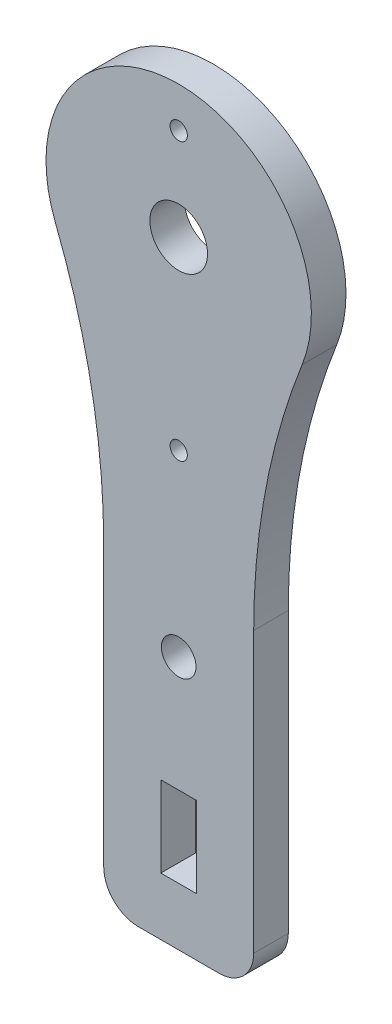
ISO-10303-21;
HEADER;
FILE_DESCRIPTION(('STEP AP214'),'2;1');
FILE_NAME('part.step','',(''),(''),'','','');
FILE_SCHEMA(('AUTOMOTIVE_DESIGN { 1 0 10303 214 1 1 1 1 }'));
ENDSEC;
DATA;
#1=APPLICATION_CONTEXT('core data for automotive mechanical design processes');
#2=APPLICATION_PROTOCOL_DEFINITION('international standard','automotive_design',2000,#1);
#3=PRODUCT_CONTEXT('',#1,'mechanical');
#4=PRODUCT('Part','Part','',(#3));
#5=PRODUCT_RELATED_PRODUCT_CATEGORY('part','',(#4));
#6=PRODUCT_DEFINITION_FORMATION('','',#4);
#7=PRODUCT_DEFINITION_CONTEXT('part definition',#1,'design');
#8=PRODUCT_DEFINITION('design','',#6,#7);
#9=PRODUCT_DEFINITION_SHAPE('','',#8);
#10=(LENGTH_UNIT() NAMED_UNIT(*) SI_UNIT(.MILLI.,.METRE.));
#11=(NAMED_UNIT(*) PLANE_ANGLE_UNIT() SI_UNIT($,.RADIAN.));
#12=(NAMED_UNIT(*) SI_UNIT($,.STERADIAN.) SOLID_ANGLE_UNIT());
#13=UNCERTAINTY_MEASURE_WITH_UNIT(LENGTH_MEASURE(1.E-05),#10,'distance_accuracy_value','');
#14=(GEOMETRIC_REPRESENTATION_CONTEXT(3) GLOBAL_UNCERTAINTY_ASSIGNED_CONTEXT((#13)) GLOBAL_UNIT_ASSIGNED_CONTEXT((#10,
#11,#12)) REPRESENTATION_CONTEXT('',''));
#15=CARTESIAN_POINT('',(0.,0.,0.));
#16=DIRECTION('',(0.,0.,1.));
#17=DIRECTION('',(1.,0.,0.));
#18=AXIS2_PLACEMENT_3D('',#15,#16,#17);
#19=CARTESIAN_POINT('',(6.50000000000002,0.,3.));
#20=DIRECTION('',(-1.,0.,0.));
#21=DIRECTION('',(0.,-1.,0.));
#22=AXIS2_PLACEMENT_3D('',#19,#20,#21);
#23=PLANE('',#22);
#24=DIRECTION('',(0.,1.,0.));
#25=VECTOR('',#24,1.);
#26=CARTESIAN_POINT('',(6.50000000000002,0.,3.));
#27=LINE('',#26,#25);
#28=CARTESIAN_POINT('',(6.50000000000001,-50.5,3.));
#29=VERTEX_POINT('',#28);
#30=CARTESIAN_POINT('',(6.50000000000001,-26.2678510731274,3.));
#31=VERTEX_POINT('',#30);
#32=EDGE_CURVE('E192',#29,#31,#27,.T.);
#33=ORIENTED_EDGE('',*,*,#32,.F.);
#34=DIRECTION('',(0.,0.,-1.));
#35=VECTOR('',#34,1.);
#36=CARTESIAN_POINT('',(6.50000000000001,-50.5,0.));
#37=LINE('',#36,#35);
#38=CARTESIAN_POINT('',(6.50000000000001,-50.5,0.));
#39=VERTEX_POINT('',#38);
#40=EDGE_CURVE('E11',#29,#39,#37,.T.);
#41=ORIENTED_EDGE('',*,*,#40,.T.);
#42=DIRECTION('',(0.,1.,0.));
#43=VECTOR('',#42,1.);
#44=CARTESIAN_POINT('',(6.50000000000002,0.,0.));
#45=LINE('',#44,#43);
#46=CARTESIAN_POINT('',(6.50000000000001,-26.2678510731274,0.));
#47=VERTEX_POINT('',#46);
#48=EDGE_CURVE('E208',#39,#47,#45,.T.);
#49=ORIENTED_EDGE('',*,*,#48,.T.);
#50=DIRECTION('',(0.,0.,1.));
#51=VECTOR('',#50,1.);
#52=CARTESIAN_POINT('',(6.50000000000001,-26.2678510731274,3.));
#53=LINE('',#52,#51);
#54=EDGE_CURVE('E228',#47,#31,#53,.T.);
#55=ORIENTED_EDGE('',*,*,#54,.T.);
#56=EDGE_LOOP('',(#33,#41,#49,#55));
#57=FACE_BOUND('',#56,.T.);
#58=ADVANCED_FACE('F41',(#57),#23,.F.);
#59=CARTESIAN_POINT('',(0.,0.,3.));
#60=DIRECTION('',(0.,0.,-1.));
#61=DIRECTION('',(-1.,0.,0.));
#62=AXIS2_PLACEMENT_3D('',#59,#60,#61);
#63=CYLINDRICAL_SURFACE('',#62,11.5);
#64=CARTESIAN_POINT('',(0.,0.,3.));
#65=DIRECTION('',(0.,0.,1.));
#66=DIRECTION('',(1.,0.,0.));
#67=AXIS2_PLACEMENT_3D('',#64,#65,#66);
#68=CIRCLE('',#67,11.5);
#69=CARTESIAN_POINT('',(10.6958041958042,-4.22489912364986,3.));
#70=VERTEX_POINT('',#69);
#71=CARTESIAN_POINT('',(-10.6958041958042,-4.22489912364986,3.));
#72=VERTEX_POINT('',#71);
#73=EDGE_CURVE('E195',#70,#72,#68,.T.);
#74=ORIENTED_EDGE('',*,*,#73,.F.);
#75=DIRECTION('',(0.,0.,-1.));
#76=VECTOR('',#75,1.);
#77=CARTESIAN_POINT('',(10.6958041958042,-4.22489912364986,3.));
#78=LINE('',#77,#76);
#79=CARTESIAN_POINT('',(10.6958041958042,-4.22489912364986,0.));
#80=VERTEX_POINT('',#79);
#81=EDGE_CURVE('E224',#70,#80,#78,.T.);
#82=ORIENTED_EDGE('',*,*,#81,.T.);
#83=CARTESIAN_POINT('',(0.,0.,0.));
#84=DIRECTION('',(0.,0.,1.));
#85=DIRECTION('',(1.,0.,0.));
#86=AXIS2_PLACEMENT_3D('',#83,#84,#85);
#87=CIRCLE('',#86,11.5);
#88=CARTESIAN_POINT('',(-10.6958041958042,-4.22489912364986,0.));
#89=VERTEX_POINT('',#88);
#90=EDGE_CURVE('E211',#80,#89,#87,.T.);
#91=ORIENTED_EDGE('',*,*,#90,.T.);
#92=DIRECTION('',(0.,0.,-1.));
#93=VECTOR('',#92,1.);
#94=CARTESIAN_POINT('',(-10.6958041958042,-4.22489912364986,3.));
#95=LINE('',#94,#93);
#96=EDGE_CURVE('E207',#89,#72,#95,.F.);
#97=ORIENTED_EDGE('',*,*,#96,.T.);
#98=EDGE_LOOP('',(#74,#82,#91,#97));
#99=FACE_BOUND('',#98,.T.);
#100=ADVANCED_FACE('F286',(#99),#63,.T.);
#101=CARTESIAN_POINT('',(-6.50000000000002,0.,3.));
#102=DIRECTION('',(-1.,0.,0.));
#103=DIRECTION('',(0.,-1.,0.));
#104=AXIS2_PLACEMENT_3D('',#101,#102,#103);
#105=PLANE('',#104);
#106=DIRECTION('',(0.,1.,0.));
#107=VECTOR('',#106,1.);
#108=CARTESIAN_POINT('',(-6.50000000000002,0.,0.));
#109=LINE('',#108,#107);
#110=CARTESIAN_POINT('',(-6.5,-50.5,0.));
#111=VERTEX_POINT('',#110);
#112=CARTESIAN_POINT('',(-6.50000000000001,-26.2678510731274,0.));
#113=VERTEX_POINT('',#112);
#114=EDGE_CURVE('E216',#111,#113,#109,.T.);
#115=ORIENTED_EDGE('',*,*,#114,.F.);
#116=DIRECTION('',(0.,0.,-1.));
#117=VECTOR('',#116,1.);
#118=CARTESIAN_POINT('',(-6.5,-50.5,3.));
#119=LINE('',#118,#117);
#120=CARTESIAN_POINT('',(-6.5,-50.5,3.));
#121=VERTEX_POINT('',#120);
#122=EDGE_CURVE('E65',#111,#121,#119,.F.);
#123=ORIENTED_EDGE('',*,*,#122,.T.);
#124=DIRECTION('',(0.,1.,0.));
#125=VECTOR('',#124,1.);
#126=CARTESIAN_POINT('',(-6.50000000000002,0.,3.));
#127=LINE('',#126,#125);
#128=CARTESIAN_POINT('',(-6.50000000000001,-26.2678510731274,3.));
#129=VERTEX_POINT('',#128);
#130=EDGE_CURVE('E200',#121,#129,#127,.T.);
#131=ORIENTED_EDGE('',*,*,#130,.T.);
#132=DIRECTION('',(0.,0.,-1.));
#133=VECTOR('',#132,1.);
#134=CARTESIAN_POINT('',(-6.50000000000001,-26.2678510731274,3.));
#135=LINE('',#134,#133);
#136=EDGE_CURVE('E232',#129,#113,#135,.T.);
#137=ORIENTED_EDGE('',*,*,#136,.T.);
#138=EDGE_LOOP('',(#115,#123,#131,#137));
#139=FACE_BOUND('',#138,.T.);
#140=ADVANCED_FACE('F277',(#139),#105,.T.);
#141=CARTESIAN_POINT('',(0.,-53.5,3.));
#142=DIRECTION('',(0.,-1.,0.));
#143=DIRECTION('',(0.,0.,-1.));
#144=AXIS2_PLACEMENT_3D('',#141,#142,#143);
#145=PLANE('',#144);
#146=DIRECTION('',(-1.,0.,0.));
#147=VECTOR('',#146,1.);
#148=CARTESIAN_POINT('',(0.,-53.5,3.));
#149=LINE('',#148,#147);
#150=CARTESIAN_POINT('',(3.50000000000001,-53.5,3.));
#151=VERTEX_POINT('',#150);
#152=CARTESIAN_POINT('',(-3.49999999999999,-53.5,3.));
#153=VERTEX_POINT('',#152);
#154=EDGE_CURVE('E203',#151,#153,#149,.T.);
#155=ORIENTED_EDGE('',*,*,#154,.T.);
#156=DIRECTION('',(0.,0.,-1.));
#157=VECTOR('',#156,1.);
#158=CARTESIAN_POINT('',(-3.49999999999999,-53.5,3.));
#159=LINE('',#158,#157);
#160=CARTESIAN_POINT('',(-3.49999999999999,-53.5,0.));
#161=VERTEX_POINT('',#160);
#162=EDGE_CURVE('E253',#153,#161,#159,.T.);
#163=ORIENTED_EDGE('',*,*,#162,.T.);
#164=DIRECTION('',(-1.,0.,0.));
#165=VECTOR('',#164,1.);
#166=CARTESIAN_POINT('',(0.,-53.5,0.));
#167=LINE('',#166,#165);
#168=CARTESIAN_POINT('',(3.50000000000001,-53.5,0.));
#169=VERTEX_POINT('',#168);
#170=EDGE_CURVE('E196',#169,#161,#167,.T.);
#171=ORIENTED_EDGE('',*,*,#170,.F.);
#172=DIRECTION('',(0.,0.,-1.));
#173=VECTOR('',#172,1.);
#174=CARTESIAN_POINT('',(3.50000000000001,-53.5,3.));
#175=LINE('',#174,#173);
#176=EDGE_CURVE('E250',#169,#151,#175,.F.);
#177=ORIENTED_EDGE('',*,*,#176,.T.);
#178=EDGE_LOOP('',(#155,#163,#171,#177));
#179=FACE_BOUND('',#178,.T.);
#180=ADVANCED_FACE('F272',(#179),#145,.T.);
#181=CARTESIAN_POINT('',(0.,0.,3.));
#182=DIRECTION('',(0.,0.,1.));
#183=DIRECTION('',(1.,0.,0.));
#184=AXIS2_PLACEMENT_3D('',#181,#182,#183);
#185=PLANE('',#184);
#186=CARTESIAN_POINT('',(0.,8.,3.));
#187=DIRECTION('',(0.,0.,1.));
#188=DIRECTION('',(1.,0.,0.));
#189=AXIS2_PLACEMENT_3D('',#186,#187,#188);
#190=CIRCLE('',#189,0.75);
#191=CARTESIAN_POINT('',(0.75,8.,3.));
#192=VERTEX_POINT('',#191);
#193=EDGE_CURVE('E487',#192,#192,#190,.T.);
#194=ORIENTED_EDGE('',*,*,#193,.F.);
#195=EDGE_LOOP('',(#194));
#196=FACE_BOUND('',#195,.T.);
#197=CARTESIAN_POINT('',(0.,-16.,3.));
#198=DIRECTION('',(0.,0.,1.));
#199=DIRECTION('',(1.,0.,0.));
#200=AXIS2_PLACEMENT_3D('',#197,#198,#199);
#201=CIRCLE('',#200,0.75);
#202=CARTESIAN_POINT('',(0.75,-16.,3.));
#203=VERTEX_POINT('',#202);
#204=EDGE_CURVE('E479',#203,#203,#201,.T.);
#205=ORIENTED_EDGE('',*,*,#204,.F.);
#206=EDGE_LOOP('',(#205));
#207=FACE_BOUND('',#206,.T.);
#208=CARTESIAN_POINT('',(0.,0.,3.));
#209=DIRECTION('',(0.,0.,1.));
#210=DIRECTION('',(1.,0.,0.));
#211=AXIS2_PLACEMENT_3D('',#208,#209,#210);
#212=CIRCLE('',#211,2.5);
#213=CARTESIAN_POINT('',(2.5,0.,3.));
#214=VERTEX_POINT('',#213);
#215=EDGE_CURVE('E470',#214,#214,#212,.T.);
#216=ORIENTED_EDGE('',*,*,#215,.F.);
#217=EDGE_LOOP('',(#216));
#218=FACE_BOUND('',#217,.T.);
#219=CARTESIAN_POINT('',(0.,-31.5,3.));
#220=DIRECTION('',(0.,0.,1.));
#221=DIRECTION('',(1.,0.,0.));
#222=AXIS2_PLACEMENT_3D('',#219,#220,#221);
#223=CIRCLE('',#222,1.5);
#224=CARTESIAN_POINT('',(1.5,-31.5,3.));
#225=VERTEX_POINT('',#224);
#226=EDGE_CURVE('E168',#225,#225,#223,.T.);
#227=ORIENTED_EDGE('',*,*,#226,.F.);
#228=EDGE_LOOP('',(#227));
#229=FACE_BOUND('',#228,.T.);
#230=DIRECTION('',(0.,-1.,0.));
#231=VECTOR('',#230,1.);
#232=CARTESIAN_POINT('',(-1.55000000000001,-41.5,3.));
#233=LINE('',#232,#231);
#234=CARTESIAN_POINT('',(-1.55000000000001,-41.5,3.));
#235=VERTEX_POINT('',#234);
#236=CARTESIAN_POINT('',(-1.55000000000001,-48.5,3.));
#237=VERTEX_POINT('',#236);
#238=EDGE_CURVE('E140',#235,#237,#233,.T.);
#239=ORIENTED_EDGE('',*,*,#238,.F.);
#240=DIRECTION('',(-1.,0.,0.));
#241=VECTOR('',#240,1.);
#242=CARTESIAN_POINT('',(1.54999999999999,-41.5,3.));
#243=LINE('',#242,#241);
#244=CARTESIAN_POINT('',(1.54999999999999,-41.5,3.));
#245=VERTEX_POINT('',#244);
#246=EDGE_CURVE('E161',#245,#235,#243,.T.);
#247=ORIENTED_EDGE('',*,*,#246,.F.);
#248=DIRECTION('',(0.,1.,0.));
#249=VECTOR('',#248,1.);
#250=CARTESIAN_POINT('',(1.54999999999999,-41.5,3.));
#251=LINE('',#250,#249);
#252=CARTESIAN_POINT('',(1.54999999999999,-48.5,3.));
#253=VERTEX_POINT('',#252);
#254=EDGE_CURVE('E165',#253,#245,#251,.T.);
#255=ORIENTED_EDGE('',*,*,#254,.F.);
#256=DIRECTION('',(1.,0.,0.));
#257=VECTOR('',#256,1.);
#258=CARTESIAN_POINT('',(1.54999999999999,-48.5,3.));
#259=LINE('',#258,#257);
#260=EDGE_CURVE('E177',#237,#253,#259,.T.);
#261=ORIENTED_EDGE('',*,*,#260,.F.);
#262=EDGE_LOOP('',(#239,#247,#255,#261));
#263=FACE_BOUND('',#262,.T.);
#264=ORIENTED_EDGE('',*,*,#130,.F.);
#265=CARTESIAN_POINT('',(-3.49999999999999,-50.5,3.));
#266=DIRECTION('',(0.,0.,1.));
#267=DIRECTION('',(1.,0.,0.));
#268=AXIS2_PLACEMENT_3D('',#265,#266,#267);
#269=CIRCLE('',#268,3.);
#270=EDGE_CURVE('E50',#121,#153,#269,.T.);
#271=ORIENTED_EDGE('',*,*,#270,.T.);
#272=ORIENTED_EDGE('',*,*,#154,.F.);
#273=CARTESIAN_POINT('',(3.50000000000001,-50.5,3.));
#274=DIRECTION('',(0.,0.,1.));
#275=DIRECTION('',(1.,0.,0.));
#276=AXIS2_PLACEMENT_3D('',#273,#274,#275);
#277=CIRCLE('',#276,3.);
#278=EDGE_CURVE('E57',#151,#29,#277,.T.);
#279=ORIENTED_EDGE('',*,*,#278,.T.);
#280=ORIENTED_EDGE('',*,*,#32,.T.);
#281=CARTESIAN_POINT('',(66.5,-26.2678510731274,3.));
#282=DIRECTION('',(0.,0.,1.));
#283=DIRECTION('',(1.,0.,0.));
#284=AXIS2_PLACEMENT_3D('',#281,#282,#283);
#285=CIRCLE('',#284,60.);
#286=EDGE_CURVE('E240',#31,#70,#285,.F.);
#287=ORIENTED_EDGE('',*,*,#286,.T.);
#288=ORIENTED_EDGE('',*,*,#73,.T.);
#289=CARTESIAN_POINT('',(-66.5,-26.2678510731274,3.));
#290=DIRECTION('',(0.,0.,1.));
#291=DIRECTION('',(1.,0.,0.));
#292=AXIS2_PLACEMENT_3D('',#289,#290,#291);
#293=CIRCLE('',#292,60.);
#294=EDGE_CURVE('E246',#72,#129,#293,.F.);
#295=ORIENTED_EDGE('',*,*,#294,.T.);
#296=EDGE_LOOP('',(#264,#271,#272,#279,#280,#287,#288,#295));
#297=FACE_BOUND('',#296,.T.);
#298=ADVANCED_FACE('F268',(#196,#207,#218,#229,#263,#297),#185,.T.);
#299=CARTESIAN_POINT('',(0.,0.,0.));
#300=DIRECTION('',(0.,0.,1.));
#301=DIRECTION('',(1.,0.,0.));
#302=AXIS2_PLACEMENT_3D('',#299,#300,#301);
#303=PLANE('',#302);
#304=CARTESIAN_POINT('',(0.,8.,0.));
#305=DIRECTION('',(0.,0.,1.));
#306=DIRECTION('',(1.,0.,0.));
#307=AXIS2_PLACEMENT_3D('',#304,#305,#306);
#308=CIRCLE('',#307,0.75);
#309=CARTESIAN_POINT('',(0.75,8.,0.));
#310=VERTEX_POINT('',#309);
#311=EDGE_CURVE('E178',#310,#310,#308,.T.);
#312=ORIENTED_EDGE('',*,*,#311,.T.);
#313=EDGE_LOOP('',(#312));
#314=FACE_BOUND('',#313,.T.);
#315=CARTESIAN_POINT('',(0.,-16.,0.));
#316=DIRECTION('',(0.,0.,1.));
#317=DIRECTION('',(1.,0.,0.));
#318=AXIS2_PLACEMENT_3D('',#315,#316,#317);
#319=CIRCLE('',#318,0.75);
#320=CARTESIAN_POINT('',(0.75,-16.,0.));
#321=VERTEX_POINT('',#320);
#322=EDGE_CURVE('E483',#321,#321,#319,.T.);
#323=ORIENTED_EDGE('',*,*,#322,.T.);
#324=EDGE_LOOP('',(#323));
#325=FACE_BOUND('',#324,.T.);
#326=CARTESIAN_POINT('',(0.,0.,0.));
#327=DIRECTION('',(0.,0.,1.));
#328=DIRECTION('',(1.,0.,0.));
#329=AXIS2_PLACEMENT_3D('',#326,#327,#328);
#330=CIRCLE('',#329,2.5);
#331=CARTESIAN_POINT('',(2.5,0.,0.));
#332=VERTEX_POINT('',#331);
#333=EDGE_CURVE('E212',#332,#332,#330,.T.);
#334=ORIENTED_EDGE('',*,*,#333,.T.);
#335=EDGE_LOOP('',(#334));
#336=FACE_BOUND('',#335,.T.);
#337=CARTESIAN_POINT('',(0.,-31.5,0.));
#338=DIRECTION('',(0.,0.,1.));
#339=DIRECTION('',(1.,0.,0.));
#340=AXIS2_PLACEMENT_3D('',#337,#338,#339);
#341=CIRCLE('',#340,1.5);
#342=CARTESIAN_POINT('',(1.5,-31.5,0.));
#343=VERTEX_POINT('',#342);
#344=EDGE_CURVE('E464',#343,#343,#341,.T.);
#345=ORIENTED_EDGE('',*,*,#344,.T.);
#346=EDGE_LOOP('',(#345));
#347=FACE_BOUND('',#346,.T.);
#348=DIRECTION('',(-1.,0.,0.));
#349=VECTOR('',#348,1.);
#350=CARTESIAN_POINT('',(1.54999999999999,-41.5,0.));
#351=LINE('',#350,#349);
#352=CARTESIAN_POINT('',(1.54999999999999,-41.5,0.));
#353=VERTEX_POINT('',#352);
#354=CARTESIAN_POINT('',(-1.55000000000001,-41.5,0.));
#355=VERTEX_POINT('',#354);
#356=EDGE_CURVE('E146',#353,#355,#351,.T.);
#357=ORIENTED_EDGE('',*,*,#356,.T.);
#358=DIRECTION('',(0.,-1.,0.));
#359=VECTOR('',#358,1.);
#360=CARTESIAN_POINT('',(-1.55000000000001,-41.5,0.));
#361=LINE('',#360,#359);
#362=CARTESIAN_POINT('',(-1.55000000000001,-48.5,0.));
#363=VERTEX_POINT('',#362);
#364=EDGE_CURVE('E137',#355,#363,#361,.T.);
#365=ORIENTED_EDGE('',*,*,#364,.T.);
#366=DIRECTION('',(1.,0.,0.));
#367=VECTOR('',#366,1.);
#368=CARTESIAN_POINT('',(1.54999999999999,-48.5,0.));
#369=LINE('',#368,#367);
#370=CARTESIAN_POINT('',(1.54999999999999,-48.5,0.));
#371=VERTEX_POINT('',#370);
#372=EDGE_CURVE('E150',#363,#371,#369,.T.);
#373=ORIENTED_EDGE('',*,*,#372,.T.);
#374=DIRECTION('',(0.,1.,0.));
#375=VECTOR('',#374,1.);
#376=CARTESIAN_POINT('',(1.54999999999999,-41.5,0.));
#377=LINE('',#376,#375);
#378=EDGE_CURVE('E155',#371,#353,#377,.T.);
#379=ORIENTED_EDGE('',*,*,#378,.T.);
#380=EDGE_LOOP('',(#357,#365,#373,#379));
#381=FACE_BOUND('',#380,.T.);
#382=ORIENTED_EDGE('',*,*,#170,.T.);
#383=CARTESIAN_POINT('',(-3.49999999999999,-50.5,0.));
#384=DIRECTION('',(0.,0.,1.));
#385=DIRECTION('',(1.,0.,0.));
#386=AXIS2_PLACEMENT_3D('',#383,#384,#385);
#387=CIRCLE('',#386,3.);
#388=EDGE_CURVE('E260',#161,#111,#387,.F.);
#389=ORIENTED_EDGE('',*,*,#388,.T.);
#390=ORIENTED_EDGE('',*,*,#114,.T.);
#391=CARTESIAN_POINT('',(-66.5,-26.2678510731274,0.));
#392=DIRECTION('',(0.,0.,1.));
#393=DIRECTION('',(1.,0.,0.));
#394=AXIS2_PLACEMENT_3D('',#391,#392,#393);
#395=CIRCLE('',#394,60.);
#396=EDGE_CURVE('E243',#113,#89,#395,.T.);
#397=ORIENTED_EDGE('',*,*,#396,.T.);
#398=ORIENTED_EDGE('',*,*,#90,.F.);
#399=CARTESIAN_POINT('',(66.5,-26.2678510731274,0.));
#400=DIRECTION('',(0.,0.,1.));
#401=DIRECTION('',(1.,0.,0.));
#402=AXIS2_PLACEMENT_3D('',#399,#400,#401);
#403=CIRCLE('',#402,60.);
#404=EDGE_CURVE('E236',#80,#47,#403,.T.);
#405=ORIENTED_EDGE('',*,*,#404,.T.);
#406=ORIENTED_EDGE('',*,*,#48,.F.);
#407=CARTESIAN_POINT('',(3.50000000000001,-50.5,0.));
#408=DIRECTION('',(0.,0.,1.));
#409=DIRECTION('',(1.,0.,0.));
#410=AXIS2_PLACEMENT_3D('',#407,#408,#409);
#411=CIRCLE('',#410,3.);
#412=EDGE_CURVE('E257',#39,#169,#411,.F.);
#413=ORIENTED_EDGE('',*,*,#412,.T.);
#414=EDGE_LOOP('',(#382,#389,#390,#397,#398,#405,#406,#413));
#415=FACE_BOUND('',#414,.T.);
#416=ADVANCED_FACE('F157',(#314,#325,#336,#347,#381,#415),#303,.F.);
#417=CARTESIAN_POINT('',(-1.55000000000001,-41.5,0.));
#418=DIRECTION('',(-1.,0.,0.));
#419=DIRECTION('',(0.,-1.,0.));
#420=AXIS2_PLACEMENT_3D('',#417,#418,#419);
#421=PLANE('',#420);
#422=ORIENTED_EDGE('',*,*,#238,.T.);
#423=DIRECTION('',(0.,0.,1.));
#424=VECTOR('',#423,1.);
#425=CARTESIAN_POINT('',(-1.55000000000001,-48.5,0.));
#426=LINE('',#425,#424);
#427=EDGE_CURVE('E133',#363,#237,#426,.T.);
#428=ORIENTED_EDGE('',*,*,#427,.F.);
#429=ORIENTED_EDGE('',*,*,#364,.F.);
#430=DIRECTION('',(0.,0.,1.));
#431=VECTOR('',#430,1.);
#432=CARTESIAN_POINT('',(-1.55000000000001,-41.5,0.));
#433=LINE('',#432,#431);
#434=EDGE_CURVE('E184',#355,#235,#433,.T.);
#435=ORIENTED_EDGE('',*,*,#434,.T.);
#436=EDGE_LOOP('',(#422,#428,#429,#435));
#437=FACE_BOUND('',#436,.T.);
#438=ADVANCED_FACE('F135',(#437),#421,.F.);
#439=CARTESIAN_POINT('',(1.54999999999999,-41.5,0.));
#440=DIRECTION('',(0.,1.,0.));
#441=DIRECTION('',(0.,0.,1.));
#442=AXIS2_PLACEMENT_3D('',#439,#440,#441);
#443=PLANE('',#442);
#444=ORIENTED_EDGE('',*,*,#246,.T.);
#445=ORIENTED_EDGE('',*,*,#434,.F.);
#446=ORIENTED_EDGE('',*,*,#356,.F.);
#447=DIRECTION('',(0.,0.,1.));
#448=VECTOR('',#447,1.);
#449=CARTESIAN_POINT('',(1.54999999999999,-41.5,0.));
#450=LINE('',#449,#448);
#451=EDGE_CURVE('E187',#353,#245,#450,.T.);
#452=ORIENTED_EDGE('',*,*,#451,.T.);
#453=EDGE_LOOP('',(#444,#445,#446,#452));
#454=FACE_BOUND('',#453,.T.);
#455=ADVANCED_FACE('F385',(#454),#443,.F.);
#456=CARTESIAN_POINT('',(1.54999999999999,-41.5,0.));
#457=DIRECTION('',(1.,0.,0.));
#458=DIRECTION('',(0.,1.,0.));
#459=AXIS2_PLACEMENT_3D('',#456,#457,#458);
#460=PLANE('',#459);
#461=ORIENTED_EDGE('',*,*,#254,.T.);
#462=ORIENTED_EDGE('',*,*,#451,.F.);
#463=ORIENTED_EDGE('',*,*,#378,.F.);
#464=DIRECTION('',(0.,0.,1.));
#465=VECTOR('',#464,1.);
#466=CARTESIAN_POINT('',(1.54999999999999,-48.5,0.));
#467=LINE('',#466,#465);
#468=EDGE_CURVE('E145',#371,#253,#467,.T.);
#469=ORIENTED_EDGE('',*,*,#468,.T.);
#470=EDGE_LOOP('',(#461,#462,#463,#469));
#471=FACE_BOUND('',#470,.T.);
#472=ADVANCED_FACE('F388',(#471),#460,.F.);
#473=CARTESIAN_POINT('',(1.54999999999999,-48.5,0.));
#474=DIRECTION('',(0.,-1.,0.));
#475=DIRECTION('',(0.,0.,-1.));
#476=AXIS2_PLACEMENT_3D('',#473,#474,#475);
#477=PLANE('',#476);
#478=ORIENTED_EDGE('',*,*,#260,.T.);
#479=ORIENTED_EDGE('',*,*,#468,.F.);
#480=ORIENTED_EDGE('',*,*,#372,.F.);
#481=ORIENTED_EDGE('',*,*,#427,.T.);
#482=EDGE_LOOP('',(#478,#479,#480,#481));
#483=FACE_BOUND('',#482,.T.);
#484=ADVANCED_FACE('F151',(#483),#477,.F.);
#485=CARTESIAN_POINT('',(0.,-31.5,0.));
#486=DIRECTION('',(0.,0.,1.));
#487=DIRECTION('',(1.,0.,0.));
#488=AXIS2_PLACEMENT_3D('',#485,#486,#487);
#489=CYLINDRICAL_SURFACE('',#488,1.5);
#490=ORIENTED_EDGE('',*,*,#344,.F.);
#491=EDGE_LOOP('',(#490));
#492=FACE_BOUND('',#491,.T.);
#493=ORIENTED_EDGE('',*,*,#226,.T.);
#494=EDGE_LOOP('',(#493));
#495=FACE_BOUND('',#494,.T.);
#496=ADVANCED_FACE('F380',(#492,#495),#489,.F.);
#497=CARTESIAN_POINT('',(0.,0.,0.));
#498=DIRECTION('',(0.,0.,1.));
#499=DIRECTION('',(1.,0.,0.));
#500=AXIS2_PLACEMENT_3D('',#497,#498,#499);
#501=CYLINDRICAL_SURFACE('',#500,2.5);
#502=ORIENTED_EDGE('',*,*,#333,.F.);
#503=EDGE_LOOP('',(#502));
#504=FACE_BOUND('',#503,.T.);
#505=ORIENTED_EDGE('',*,*,#215,.T.);
#506=EDGE_LOOP('',(#505));
#507=FACE_BOUND('',#506,.T.);
#508=ADVANCED_FACE('F315',(#504,#507),#501,.F.);
#509=CARTESIAN_POINT('',(66.5,-26.2678510731274,3.));
#510=DIRECTION('',(0.,0.,-1.));
#511=DIRECTION('',(-1.,0.,0.));
#512=AXIS2_PLACEMENT_3D('',#509,#510,#511);
#513=CYLINDRICAL_SURFACE('',#512,60.);
#514=ORIENTED_EDGE('',*,*,#286,.F.);
#515=ORIENTED_EDGE('',*,*,#54,.F.);
#516=ORIENTED_EDGE('',*,*,#404,.F.);
#517=ORIENTED_EDGE('',*,*,#81,.F.);
#518=EDGE_LOOP('',(#514,#515,#516,#517));
#519=FACE_BOUND('',#518,.T.);
#520=ADVANCED_FACE('F290',(#519),#513,.F.);
#521=CARTESIAN_POINT('',(-66.5,-26.2678510731274,3.));
#522=DIRECTION('',(0.,0.,-1.));
#523=DIRECTION('',(-1.,0.,0.));
#524=AXIS2_PLACEMENT_3D('',#521,#522,#523);
#525=CYLINDRICAL_SURFACE('',#524,60.);
#526=ORIENTED_EDGE('',*,*,#294,.F.);
#527=ORIENTED_EDGE('',*,*,#96,.F.);
#528=ORIENTED_EDGE('',*,*,#396,.F.);
#529=ORIENTED_EDGE('',*,*,#136,.F.);
#530=EDGE_LOOP('',(#526,#527,#528,#529));
#531=FACE_BOUND('',#530,.T.);
#532=ADVANCED_FACE('F281',(#531),#525,.F.);
#533=CARTESIAN_POINT('',(-3.49999999999999,-50.5,3.));
#534=DIRECTION('',(0.,0.,-1.));
#535=DIRECTION('',(-1.,0.,0.));
#536=AXIS2_PLACEMENT_3D('',#533,#534,#535);
#537=CYLINDRICAL_SURFACE('',#536,3.);
#538=ORIENTED_EDGE('',*,*,#270,.F.);
#539=ORIENTED_EDGE('',*,*,#122,.F.);
#540=ORIENTED_EDGE('',*,*,#388,.F.);
#541=ORIENTED_EDGE('',*,*,#162,.F.);
#542=EDGE_LOOP('',(#538,#539,#540,#541));
#543=FACE_BOUND('',#542,.T.);
#544=ADVANCED_FACE('F275',(#543),#537,.T.);
#545=CARTESIAN_POINT('',(3.50000000000001,-50.5,3.));
#546=DIRECTION('',(0.,0.,1.));
#547=DIRECTION('',(1.,0.,0.));
#548=AXIS2_PLACEMENT_3D('',#545,#546,#547);
#549=CYLINDRICAL_SURFACE('',#548,3.);
#550=ORIENTED_EDGE('',*,*,#278,.F.);
#551=ORIENTED_EDGE('',*,*,#176,.F.);
#552=ORIENTED_EDGE('',*,*,#412,.F.);
#553=ORIENTED_EDGE('',*,*,#40,.F.);
#554=EDGE_LOOP('',(#550,#551,#552,#553));
#555=FACE_BOUND('',#554,.T.);
#556=ADVANCED_FACE('F43',(#555),#549,.T.);
#557=CARTESIAN_POINT('',(0.,-16.,0.));
#558=DIRECTION('',(0.,0.,1.));
#559=DIRECTION('',(1.,0.,0.));
#560=AXIS2_PLACEMENT_3D('',#557,#558,#559);
#561=CYLINDRICAL_SURFACE('',#560,0.75);
#562=ORIENTED_EDGE('',*,*,#322,.F.);
#563=EDGE_LOOP('',(#562));
#564=FACE_BOUND('',#563,.T.);
#565=ORIENTED_EDGE('',*,*,#204,.T.);
#566=EDGE_LOOP('',(#565));
#567=FACE_BOUND('',#566,.T.);
#568=ADVANCED_FACE('F297',(#564,#567),#561,.F.);
#569=CARTESIAN_POINT('',(0.,8.,0.));
#570=DIRECTION('',(0.,0.,1.));
#571=DIRECTION('',(1.,0.,0.));
#572=AXIS2_PLACEMENT_3D('',#569,#570,#571);
#573=CYLINDRICAL_SURFACE('',#572,0.75);
#574=ORIENTED_EDGE('',*,*,#311,.F.);
#575=EDGE_LOOP('',(#574));
#576=FACE_BOUND('',#575,.T.);
#577=ORIENTED_EDGE('',*,*,#193,.T.);
#578=EDGE_LOOP('',(#577));
#579=FACE_BOUND('',#578,.T.);
#580=ADVANCED_FACE('F302',(#576,#579),#573,.F.);
#581=CLOSED_SHELL('',(#58,#100,#140,#180,#298,#416,#438,#455,#472,#484,#496,#508,#520,#532,#544,
#556,#568,#580));
#582=MANIFOLD_SOLID_BREP('B2',#581);
#583=ADVANCED_BREP_SHAPE_REPRESENTATION('',(#18,#582),#14);
#584=SHAPE_DEFINITION_REPRESENTATION(#9,#583);
ENDSEC;
END-ISO-10303-21;
